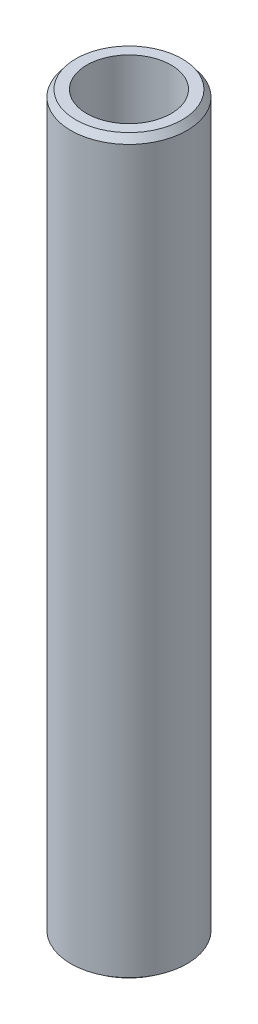
ISO-10303-21;
HEADER;
FILE_DESCRIPTION(('STEP AP214'),'2;1');
FILE_NAME('part.step','',(''),(''),'','','');
FILE_SCHEMA(('AUTOMOTIVE_DESIGN { 1 0 10303 214 1 1 1 1 }'));
ENDSEC;
DATA;
#1=APPLICATION_CONTEXT('core data for automotive mechanical design processes');
#2=APPLICATION_PROTOCOL_DEFINITION('international standard','automotive_design',2000,#1);
#3=PRODUCT_CONTEXT('',#1,'mechanical');
#4=PRODUCT('Part','Part','',(#3));
#5=PRODUCT_RELATED_PRODUCT_CATEGORY('part','',(#4));
#6=PRODUCT_DEFINITION_FORMATION('','',#4);
#7=PRODUCT_DEFINITION_CONTEXT('part definition',#1,'design');
#8=PRODUCT_DEFINITION('design','',#6,#7);
#9=PRODUCT_DEFINITION_SHAPE('','',#8);
#10=(LENGTH_UNIT() NAMED_UNIT(*) SI_UNIT(.MILLI.,.METRE.));
#11=(NAMED_UNIT(*) PLANE_ANGLE_UNIT() SI_UNIT($,.RADIAN.));
#12=(NAMED_UNIT(*) SI_UNIT($,.STERADIAN.) SOLID_ANGLE_UNIT());
#13=UNCERTAINTY_MEASURE_WITH_UNIT(LENGTH_MEASURE(1.E-05),#10,'distance_accuracy_value','');
#14=(GEOMETRIC_REPRESENTATION_CONTEXT(3) GLOBAL_UNCERTAINTY_ASSIGNED_CONTEXT((#13)) GLOBAL_UNIT_ASSIGNED_CONTEXT((#10,
#11,#12)) REPRESENTATION_CONTEXT('',''));
#15=CARTESIAN_POINT('',(0.,0.,0.));
#16=DIRECTION('',(0.,0.,1.));
#17=DIRECTION('',(1.,0.,0.));
#18=AXIS2_PLACEMENT_3D('',#15,#16,#17);
#19=CARTESIAN_POINT('',(0.,600.,0.));
#20=DIRECTION('',(0.,-1.,0.));
#21=DIRECTION('',(0.,0.,-1.));
#22=AXIS2_PLACEMENT_3D('',#19,#20,#21);
#23=CYLINDRICAL_SURFACE('',#22,47.5);
#24=CARTESIAN_POINT('',(0.,594.521686783949,0.));
#25=DIRECTION('',(0.,1.,0.));
#26=DIRECTION('',(0.,0.,1.));
#27=AXIS2_PLACEMENT_3D('',#24,#25,#26);
#28=CIRCLE('',#27,47.5);
#29=CARTESIAN_POINT('',(0.,594.521686783949,47.5));
#30=VERTEX_POINT('',#29);
#31=EDGE_CURVE('E50',#30,#30,#28,.F.);
#32=ORIENTED_EDGE('',*,*,#31,.T.);
#33=EDGE_LOOP('',(#32));
#34=FACE_BOUND('',#33,.T.);
#35=CARTESIAN_POINT('',(0.,4.0999298055383,0.));
#36=DIRECTION('',(0.,1.,0.));
#37=DIRECTION('',(0.,0.,1.));
#38=AXIS2_PLACEMENT_3D('',#35,#36,#37);
#39=CIRCLE('',#38,47.5);
#40=CARTESIAN_POINT('',(0.,4.0999298055383,47.5));
#41=VERTEX_POINT('',#40);
#42=EDGE_CURVE('E51',#41,#41,#39,.T.);
#43=ORIENTED_EDGE('',*,*,#42,.T.);
#44=EDGE_LOOP('',(#43));
#45=FACE_BOUND('',#44,.T.);
#46=ADVANCED_FACE('F39',(#34,#45),#23,.T.);
#47=CARTESIAN_POINT('',(0.,600.,0.));
#48=DIRECTION('',(0.,1.,0.));
#49=DIRECTION('',(0.,0.,1.));
#50=AXIS2_PLACEMENT_3D('',#47,#48,#49);
#51=PLANE('',#50);
#52=CARTESIAN_POINT('',(0.,600.,0.));
#53=DIRECTION('',(0.,1.,0.));
#54=DIRECTION('',(0.,0.,1.));
#55=AXIS2_PLACEMENT_3D('',#52,#53,#54);
#56=CIRCLE('',#55,43.4000701944618);
#57=CARTESIAN_POINT('',(0.,600.,43.4000701944618));
#58=VERTEX_POINT('',#57);
#59=EDGE_CURVE('E54',#58,#58,#56,.T.);
#60=ORIENTED_EDGE('',*,*,#59,.T.);
#61=EDGE_LOOP('',(#60));
#62=FACE_BOUND('',#61,.T.);
#63=CARTESIAN_POINT('',(0.,600.,0.));
#64=DIRECTION('',(0.,1.,0.));
#65=DIRECTION('',(0.,0.,1.));
#66=AXIS2_PLACEMENT_3D('',#63,#64,#65);
#67=CIRCLE('',#66,34.4797992929448);
#68=CARTESIAN_POINT('',(0.,600.,34.4797992929448));
#69=VERTEX_POINT('',#68);
#70=EDGE_CURVE('E58',#69,#69,#67,.T.);
#71=ORIENTED_EDGE('',*,*,#70,.F.);
#72=EDGE_LOOP('',(#71));
#73=FACE_BOUND('',#72,.T.);
#74=ADVANCED_FACE('F69',(#62,#73),#51,.T.);
#75=CARTESIAN_POINT('',(0.,0.,0.));
#76=DIRECTION('',(0.,1.,0.));
#77=DIRECTION('',(0.,0.,1.));
#78=AXIS2_PLACEMENT_3D('',#75,#76,#77);
#79=PLANE('',#78);
#80=CARTESIAN_POINT('',(0.,0.,0.));
#81=DIRECTION('',(0.,1.,0.));
#82=DIRECTION('',(0.,0.,1.));
#83=AXIS2_PLACEMENT_3D('',#80,#81,#82);
#84=CIRCLE('',#83,42.0216867839492);
#85=CARTESIAN_POINT('',(0.,0.,42.0216867839492));
#86=VERTEX_POINT('',#85);
#87=EDGE_CURVE('E10',#86,#86,#84,.F.);
#88=ORIENTED_EDGE('',*,*,#87,.T.);
#89=EDGE_LOOP('',(#88));
#90=FACE_BOUND('',#89,.T.);
#91=CARTESIAN_POINT('',(0.,0.,0.));
#92=DIRECTION('',(0.,1.,0.));
#93=DIRECTION('',(0.,0.,1.));
#94=AXIS2_PLACEMENT_3D('',#91,#92,#93);
#95=CIRCLE('',#94,34.4797992929448);
#96=CARTESIAN_POINT('',(0.,0.,34.4797992929448));
#97=VERTEX_POINT('',#96);
#98=EDGE_CURVE('E63',#97,#97,#95,.T.);
#99=ORIENTED_EDGE('',*,*,#98,.T.);
#100=EDGE_LOOP('',(#99));
#101=FACE_BOUND('',#100,.T.);
#102=ADVANCED_FACE('F75',(#90,#101),#79,.F.);
#103=CARTESIAN_POINT('',(0.,600.,0.));
#104=DIRECTION('',(0.,-1.,0.));
#105=DIRECTION('',(0.,0.,-1.));
#106=AXIS2_PLACEMENT_3D('',#103,#104,#105);
#107=CYLINDRICAL_SURFACE('',#106,34.4797992929448);
#108=ORIENTED_EDGE('',*,*,#70,.T.);
#109=EDGE_LOOP('',(#108));
#110=FACE_BOUND('',#109,.T.);
#111=ORIENTED_EDGE('',*,*,#98,.F.);
#112=EDGE_LOOP('',(#111));
#113=FACE_BOUND('',#112,.T.);
#114=ADVANCED_FACE('F70',(#110,#113),#107,.F.);
#115=CARTESIAN_POINT('',(0.,600.,0.));
#116=DIRECTION('',(0.,-1.,0.));
#117=DIRECTION('',(0.,0.,-1.));
#118=AXIS2_PLACEMENT_3D('',#115,#116,#117);
#119=CONICAL_SURFACE('',#118,43.4000701944618,0.642471664721383);
#120=ORIENTED_EDGE('',*,*,#31,.F.);
#121=EDGE_LOOP('',(#120));
#122=FACE_BOUND('',#121,.T.);
#123=ORIENTED_EDGE('',*,*,#59,.F.);
#124=EDGE_LOOP('',(#123));
#125=FACE_BOUND('',#124,.T.);
#126=ADVANCED_FACE('F81',(#122,#125),#119,.T.);
#127=CARTESIAN_POINT('',(0.,4.0999298055383,0.));
#128=DIRECTION('',(0.,1.,0.));
#129=DIRECTION('',(0.,0.,1.));
#130=AXIS2_PLACEMENT_3D('',#127,#128,#129);
#131=CONICAL_SURFACE('',#130,47.5,0.928324662073505);
#132=ORIENTED_EDGE('',*,*,#87,.F.);
#133=EDGE_LOOP('',(#132));
#134=FACE_BOUND('',#133,.T.);
#135=ORIENTED_EDGE('',*,*,#42,.F.);
#136=EDGE_LOOP('',(#135));
#137=FACE_BOUND('',#136,.T.);
#138=ADVANCED_FACE('F45',(#134,#137),#131,.T.);
#139=CLOSED_SHELL('',(#46,#74,#102,#114,#126,#138));
#140=MANIFOLD_SOLID_BREP('B2',#139);
#141=ADVANCED_BREP_SHAPE_REPRESENTATION('',(#18,#140),#14);
#142=SHAPE_DEFINITION_REPRESENTATION(#9,#141);
ENDSEC;
END-ISO-10303-21;
